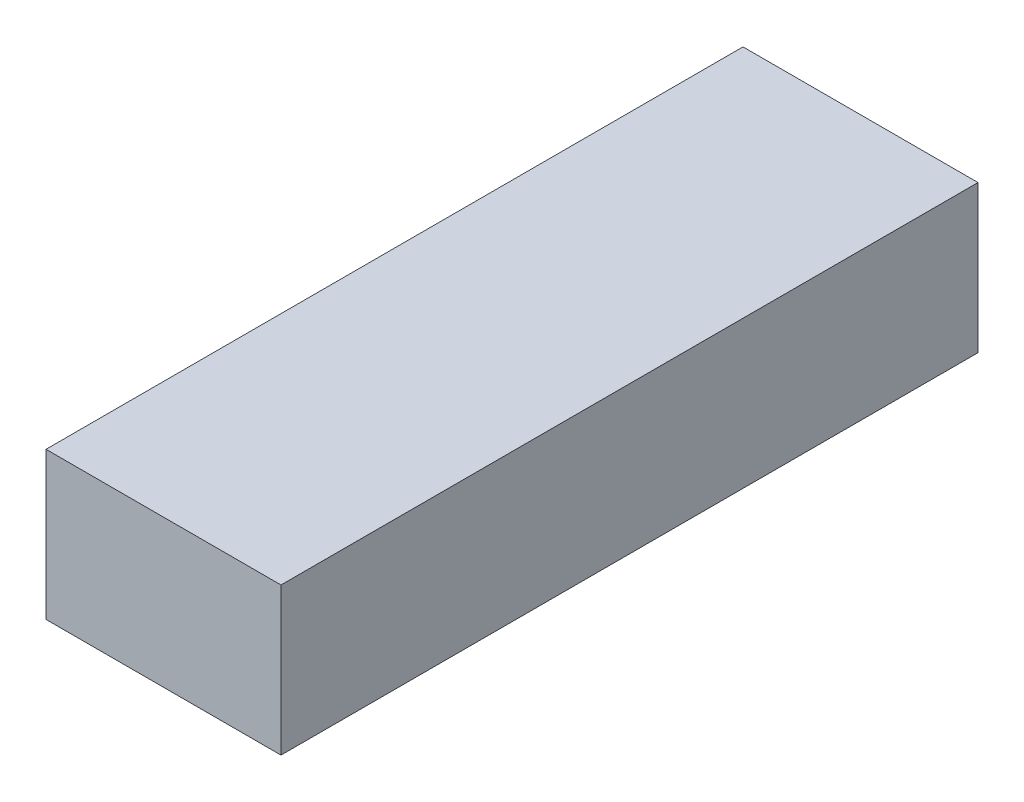
ISO-10303-21;
HEADER;
FILE_DESCRIPTION(('STEP AP214'),'2;1');
FILE_NAME('part.step','',(''),(''),'','','');
FILE_SCHEMA(('AUTOMOTIVE_DESIGN { 1 0 10303 214 1 1 1 1 }'));
ENDSEC;
DATA;
#1=APPLICATION_CONTEXT('core data for automotive mechanical design processes');
#2=APPLICATION_PROTOCOL_DEFINITION('international standard','automotive_design',2000,#1);
#3=PRODUCT_CONTEXT('',#1,'mechanical');
#4=PRODUCT('Part','Part','',(#3));
#5=PRODUCT_RELATED_PRODUCT_CATEGORY('part','',(#4));
#6=PRODUCT_DEFINITION_FORMATION('','',#4);
#7=PRODUCT_DEFINITION_CONTEXT('part definition',#1,'design');
#8=PRODUCT_DEFINITION('design','',#6,#7);
#9=PRODUCT_DEFINITION_SHAPE('','',#8);
#10=(LENGTH_UNIT() NAMED_UNIT(*) SI_UNIT(.MILLI.,.METRE.));
#11=(NAMED_UNIT(*) PLANE_ANGLE_UNIT() SI_UNIT($,.RADIAN.));
#12=(NAMED_UNIT(*) SI_UNIT($,.STERADIAN.) SOLID_ANGLE_UNIT());
#13=UNCERTAINTY_MEASURE_WITH_UNIT(LENGTH_MEASURE(1.E-05),#10,'distance_accuracy_value','');
#14=(GEOMETRIC_REPRESENTATION_CONTEXT(3) GLOBAL_UNCERTAINTY_ASSIGNED_CONTEXT((#13)) GLOBAL_UNIT_ASSIGNED_CONTEXT((#10,
#11,#12)) REPRESENTATION_CONTEXT('',''));
#15=CARTESIAN_POINT('',(0.,0.,0.));
#16=DIRECTION('',(0.,0.,1.));
#17=DIRECTION('',(1.,0.,0.));
#18=AXIS2_PLACEMENT_3D('',#15,#16,#17);
#19=CARTESIAN_POINT('',(0.,2.8,0.));
#20=DIRECTION('',(0.,1.,0.));
#21=DIRECTION('',(0.,0.,1.));
#22=AXIS2_PLACEMENT_3D('',#19,#20,#21);
#23=PLANE('',#22);
#24=CARTESIAN_POINT('',(0.,2.8,-19.9867964562161));
#25=DIRECTION('',(0.,1.,0.));
#26=DIRECTION('',(0.,0.,-1.));
#27=AXIS2_PLACEMENT_3D('',#24,#25,#26);
#28=ELLIPSE('',#27,4.1886347740287,4.125);
#29=CARTESIAN_POINT('',(-3.4,2.8,-17.6150361499228));
#30=VERTEX_POINT('',#29);
#31=CARTESIAN_POINT('',(3.4,2.8,-17.6150361499228));
#32=VERTEX_POINT('',#31);
#33=EDGE_CURVE('E157',#30,#32,#28,.T.);
#34=ORIENTED_EDGE('',*,*,#33,.F.);
#35=DIRECTION('',(0.,0.,1.));
#36=VECTOR('',#35,1.);
#37=CARTESIAN_POINT('',(-3.4,2.8,0.));
#38=LINE('',#37,#36);
#39=CARTESIAN_POINT('',(-3.4,2.8,-3.9));
#40=VERTEX_POINT('',#39);
#41=EDGE_CURVE('E190',#30,#40,#38,.T.);
#42=ORIENTED_EDGE('',*,*,#41,.T.);
#43=DIRECTION('',(-1.,0.,0.));
#44=VECTOR('',#43,1.);
#45=CARTESIAN_POINT('',(-3.9,2.8,-3.9));
#46=LINE('',#45,#44);
#47=CARTESIAN_POINT('',(3.4,2.8,-3.9));
#48=VERTEX_POINT('',#47);
#49=EDGE_CURVE('E220',#48,#40,#46,.T.);
#50=ORIENTED_EDGE('',*,*,#49,.F.);
#51=DIRECTION('',(0.,0.,1.));
#52=VECTOR('',#51,1.);
#53=CARTESIAN_POINT('',(3.4,2.8,0.));
#54=LINE('',#53,#52);
#55=EDGE_CURVE('E199',#32,#48,#54,.T.);
#56=ORIENTED_EDGE('',*,*,#55,.F.);
#57=EDGE_LOOP('',(#34,#42,#50,#56));
#58=FACE_BOUND('',#57,.T.);
#59=ADVANCED_FACE('F34',(#58),#23,.T.);
#60=CARTESIAN_POINT('',(-3.4,5.8,0.));
#61=DIRECTION('',(1.,0.,0.));
#62=DIRECTION('',(0.,0.,-1.));
#63=AXIS2_PLACEMENT_3D('',#60,#61,#62);
#64=PLANE('',#63);
#65=DIRECTION('',(0.,-0.984807753012208,-0.173648177666931));
#66=VECTOR('',#65,1.);
#67=CARTESIAN_POINT('',(-3.4,16.9730410274829,-15.1159466180895));
#68=LINE('',#67,#66);
#69=CARTESIAN_POINT('',(-3.4,5.8,-17.0860552077974));
#70=VERTEX_POINT('',#69);
#71=EDGE_CURVE('E299',#70,#30,#68,.T.);
#72=ORIENTED_EDGE('',*,*,#71,.F.);
#73=DIRECTION('',(0.,0.,1.));
#74=VECTOR('',#73,1.);
#75=CARTESIAN_POINT('',(-3.4,5.8,0.));
#76=LINE('',#75,#74);
#77=CARTESIAN_POINT('',(-3.4,5.8,3.4));
#78=VERTEX_POINT('',#77);
#79=EDGE_CURVE('E202',#70,#78,#76,.T.);
#80=ORIENTED_EDGE('',*,*,#79,.T.);
#81=DIRECTION('',(0.,-1.,0.));
#82=VECTOR('',#81,1.);
#83=CARTESIAN_POINT('',(-3.4,5.8,3.4));
#84=LINE('',#83,#82);
#85=CARTESIAN_POINT('',(-3.4,2.8,3.4));
#86=VERTEX_POINT('',#85);
#87=EDGE_CURVE('E187',#78,#86,#84,.T.);
#88=ORIENTED_EDGE('',*,*,#87,.T.);
#89=EDGE_CURVE('E191',#40,#86,#38,.T.);
#90=ORIENTED_EDGE('',*,*,#89,.F.);
#91=ORIENTED_EDGE('',*,*,#41,.F.);
#92=EDGE_LOOP('',(#72,#80,#88,#90,#91));
#93=FACE_BOUND('',#92,.T.);
#94=ADVANCED_FACE('F294',(#93),#64,.T.);
#95=CARTESIAN_POINT('',(3.4,5.8,0.));
#96=DIRECTION('',(1.,0.,0.));
#97=DIRECTION('',(0.,0.,-1.));
#98=AXIS2_PLACEMENT_3D('',#95,#96,#97);
#99=PLANE('',#98);
#100=DIRECTION('',(0.,0.,1.));
#101=VECTOR('',#100,1.);
#102=CARTESIAN_POINT('',(3.4,5.8,0.));
#103=LINE('',#102,#101);
#104=CARTESIAN_POINT('',(3.4,5.8,-17.0860552077974));
#105=VERTEX_POINT('',#104);
#106=CARTESIAN_POINT('',(3.4,5.8,3.4));
#107=VERTEX_POINT('',#106);
#108=EDGE_CURVE('E167',#105,#107,#103,.T.);
#109=ORIENTED_EDGE('',*,*,#108,.F.);
#110=DIRECTION('',(0.,-0.984807753012208,-0.173648177666931));
#111=VECTOR('',#110,1.);
#112=CARTESIAN_POINT('',(3.4,16.9730410274829,-15.1159466180895));
#113=LINE('',#112,#111);
#114=EDGE_CURVE('E153',#105,#32,#113,.T.);
#115=ORIENTED_EDGE('',*,*,#114,.T.);
#116=ORIENTED_EDGE('',*,*,#55,.T.);
#117=CARTESIAN_POINT('',(3.4,2.8,3.4));
#118=VERTEX_POINT('',#117);
#119=EDGE_CURVE('E194',#48,#118,#54,.T.);
#120=ORIENTED_EDGE('',*,*,#119,.T.);
#121=DIRECTION('',(0.,-1.,0.));
#122=VECTOR('',#121,1.);
#123=CARTESIAN_POINT('',(3.4,5.8,3.4));
#124=LINE('',#123,#122);
#125=EDGE_CURVE('E176',#107,#118,#124,.T.);
#126=ORIENTED_EDGE('',*,*,#125,.F.);
#127=EDGE_LOOP('',(#109,#115,#116,#120,#126));
#128=FACE_BOUND('',#127,.T.);
#129=ADVANCED_FACE('F174',(#128),#99,.F.);
#130=CARTESIAN_POINT('',(3.4,2.8,-22.3585567625094));
#131=VERTEX_POINT('',#130);
#132=CARTESIAN_POINT('',(-3.4,2.8,-22.3585567625094));
#133=VERTEX_POINT('',#132);
#134=EDGE_CURVE('E312',#131,#133,#28,.T.);
#135=ORIENTED_EDGE('',*,*,#134,.F.);
#136=CARTESIAN_POINT('',(3.4,2.8,-24.7));
#137=VERTEX_POINT('',#136);
#138=EDGE_CURVE('E195',#137,#131,#54,.T.);
#139=ORIENTED_EDGE('',*,*,#138,.F.);
#140=DIRECTION('',(-1.,0.,0.));
#141=VECTOR('',#140,1.);
#142=CARTESIAN_POINT('',(0.,2.8,-24.7));
#143=LINE('',#142,#141);
#144=CARTESIAN_POINT('',(-3.4,2.8,-24.7));
#145=VERTEX_POINT('',#144);
#146=EDGE_CURVE('E189',#137,#145,#143,.T.);
#147=ORIENTED_EDGE('',*,*,#146,.T.);
#148=EDGE_CURVE('E57',#145,#133,#38,.T.);
#149=ORIENTED_EDGE('',*,*,#148,.T.);
#150=EDGE_LOOP('',(#135,#139,#147,#149));
#151=FACE_BOUND('',#150,.T.);
#152=ADVANCED_FACE('F322',(#151),#23,.T.);
#153=CARTESIAN_POINT('',(0.,0.,0.));
#154=DIRECTION('',(0.,1.,0.));
#155=DIRECTION('',(0.,0.,1.));
#156=AXIS2_PLACEMENT_3D('',#153,#154,#155);
#157=PLANE('',#156);
#158=CARTESIAN_POINT('',(0.,0.,-20.4805120021998));
#159=DIRECTION('',(0.,1.,0.));
#160=DIRECTION('',(0.,0.,-1.));
#161=AXIS2_PLACEMENT_3D('',#158,#159,#160);
#162=ELLIPSE('',#161,4.1886347740287,4.125);
#163=CARTESIAN_POINT('',(0.,0.,-24.6691467762285));
#164=VERTEX_POINT('',#163);
#165=EDGE_CURVE('E313',#164,#164,#162,.T.);
#166=ORIENTED_EDGE('',*,*,#165,.T.);
#167=EDGE_LOOP('',(#166));
#168=FACE_BOUND('',#167,.T.);
#169=DIRECTION('',(0.,0.,-1.));
#170=VECTOR('',#169,1.);
#171=CARTESIAN_POINT('',(5.9,0.,-26.7));
#172=LINE('',#171,#170);
#173=CARTESIAN_POINT('',(5.9,0.,8.3));
#174=VERTEX_POINT('',#173);
#175=CARTESIAN_POINT('',(5.9,0.,-26.7));
#176=VERTEX_POINT('',#175);
#177=EDGE_CURVE('E246',#174,#176,#172,.T.);
#178=ORIENTED_EDGE('',*,*,#177,.F.);
#179=DIRECTION('',(1.,0.,0.));
#180=VECTOR('',#179,1.);
#181=CARTESIAN_POINT('',(-5.9,0.,8.3));
#182=LINE('',#181,#180);
#183=CARTESIAN_POINT('',(-5.9,0.,8.3));
#184=VERTEX_POINT('',#183);
#185=EDGE_CURVE('E253',#184,#174,#182,.T.);
#186=ORIENTED_EDGE('',*,*,#185,.F.);
#187=DIRECTION('',(0.,0.,1.));
#188=VECTOR('',#187,1.);
#189=CARTESIAN_POINT('',(-5.9,0.,-26.7));
#190=LINE('',#189,#188);
#191=CARTESIAN_POINT('',(-5.9,0.,-26.7));
#192=VERTEX_POINT('',#191);
#193=EDGE_CURVE('E251',#192,#184,#190,.T.);
#194=ORIENTED_EDGE('',*,*,#193,.F.);
#195=DIRECTION('',(-1.,0.,0.));
#196=VECTOR('',#195,1.);
#197=CARTESIAN_POINT('',(-5.9,0.,-26.7));
#198=LINE('',#197,#196);
#199=EDGE_CURVE('E249',#176,#192,#198,.T.);
#200=ORIENTED_EDGE('',*,*,#199,.F.);
#201=EDGE_LOOP('',(#178,#186,#194,#200));
#202=FACE_BOUND('',#201,.T.);
#203=DIRECTION('',(0.,0.,-1.));
#204=VECTOR('',#203,1.);
#205=CARTESIAN_POINT('',(3.9,0.,-3.9));
#206=LINE('',#205,#204);
#207=CARTESIAN_POINT('',(3.9,0.,3.9));
#208=VERTEX_POINT('',#207);
#209=CARTESIAN_POINT('',(3.9,0.,-3.9));
#210=VERTEX_POINT('',#209);
#211=EDGE_CURVE('E210',#208,#210,#206,.T.);
#212=ORIENTED_EDGE('',*,*,#211,.T.);
#213=DIRECTION('',(-1.,0.,0.));
#214=VECTOR('',#213,1.);
#215=CARTESIAN_POINT('',(-3.9,0.,-3.9));
#216=LINE('',#215,#214);
#217=CARTESIAN_POINT('',(-3.9,0.,-3.9));
#218=VERTEX_POINT('',#217);
#219=EDGE_CURVE('E229',#210,#218,#216,.T.);
#220=ORIENTED_EDGE('',*,*,#219,.T.);
#221=DIRECTION('',(0.,0.,1.));
#222=VECTOR('',#221,1.);
#223=CARTESIAN_POINT('',(-3.9,0.,-3.9));
#224=LINE('',#223,#222);
#225=CARTESIAN_POINT('',(-3.9,0.,3.9));
#226=VERTEX_POINT('',#225);
#227=EDGE_CURVE('E232',#218,#226,#224,.T.);
#228=ORIENTED_EDGE('',*,*,#227,.T.);
#229=DIRECTION('',(1.,0.,0.));
#230=VECTOR('',#229,1.);
#231=CARTESIAN_POINT('',(-3.9,0.,3.9));
#232=LINE('',#231,#230);
#233=EDGE_CURVE('E215',#226,#208,#232,.T.);
#234=ORIENTED_EDGE('',*,*,#233,.T.);
#235=EDGE_LOOP('',(#212,#220,#228,#234));
#236=FACE_BOUND('',#235,.T.);
#237=ADVANCED_FACE('F273',(#168,#202,#236),#157,.F.);
#238=CARTESIAN_POINT('',(5.9,2.8,-26.7));
#239=DIRECTION('',(-1.,0.,0.));
#240=DIRECTION('',(0.,0.,1.));
#241=AXIS2_PLACEMENT_3D('',#238,#239,#240);
#242=PLANE('',#241);
#243=ORIENTED_EDGE('',*,*,#177,.T.);
#244=DIRECTION('',(0.,-1.,0.));
#245=VECTOR('',#244,1.);
#246=CARTESIAN_POINT('',(5.9,2.8,-26.7));
#247=LINE('',#246,#245);
#248=CARTESIAN_POINT('',(5.9,7.4,-26.7));
#249=VERTEX_POINT('',#248);
#250=EDGE_CURVE('E11',#249,#176,#247,.T.);
#251=ORIENTED_EDGE('',*,*,#250,.F.);
#252=DIRECTION('',(0.,0.,-1.));
#253=VECTOR('',#252,1.);
#254=CARTESIAN_POINT('',(5.9,7.4,8.3));
#255=LINE('',#254,#253);
#256=CARTESIAN_POINT('',(5.9,7.4,8.3));
#257=VERTEX_POINT('',#256);
#258=EDGE_CURVE('E282',#257,#249,#255,.T.);
#259=ORIENTED_EDGE('',*,*,#258,.F.);
#260=DIRECTION('',(0.,-1.,0.));
#261=VECTOR('',#260,1.);
#262=CARTESIAN_POINT('',(5.9,2.8,8.3));
#263=LINE('',#262,#261);
#264=EDGE_CURVE('E255',#257,#174,#263,.T.);
#265=ORIENTED_EDGE('',*,*,#264,.T.);
#266=EDGE_LOOP('',(#243,#251,#259,#265));
#267=FACE_BOUND('',#266,.T.);
#268=ADVANCED_FACE('F36',(#267),#242,.F.);
#269=CARTESIAN_POINT('',(-5.9,2.8,-26.7));
#270=DIRECTION('',(0.,0.,1.));
#271=DIRECTION('',(1.,0.,0.));
#272=AXIS2_PLACEMENT_3D('',#269,#270,#271);
#273=PLANE('',#272);
#274=ORIENTED_EDGE('',*,*,#199,.T.);
#275=DIRECTION('',(0.,-1.,0.));
#276=VECTOR('',#275,1.);
#277=CARTESIAN_POINT('',(-5.9,2.8,-26.7));
#278=LINE('',#277,#276);
#279=CARTESIAN_POINT('',(-5.9,7.4,-26.7));
#280=VERTEX_POINT('',#279);
#281=EDGE_CURVE('E42',#280,#192,#278,.T.);
#282=ORIENTED_EDGE('',*,*,#281,.F.);
#283=DIRECTION('',(-1.,0.,0.));
#284=VECTOR('',#283,1.);
#285=CARTESIAN_POINT('',(5.9,7.4,-26.7));
#286=LINE('',#285,#284);
#287=EDGE_CURVE('E284',#249,#280,#286,.T.);
#288=ORIENTED_EDGE('',*,*,#287,.F.);
#289=ORIENTED_EDGE('',*,*,#250,.T.);
#290=EDGE_LOOP('',(#274,#282,#288,#289));
#291=FACE_BOUND('',#290,.T.);
#292=ADVANCED_FACE('F399',(#291),#273,.F.);
#293=CARTESIAN_POINT('',(-5.9,2.8,-26.7));
#294=DIRECTION('',(1.,0.,0.));
#295=DIRECTION('',(0.,0.,-1.));
#296=AXIS2_PLACEMENT_3D('',#293,#294,#295);
#297=PLANE('',#296);
#298=ORIENTED_EDGE('',*,*,#193,.T.);
#299=DIRECTION('',(0.,-1.,0.));
#300=VECTOR('',#299,1.);
#301=CARTESIAN_POINT('',(-5.9,2.8,8.3));
#302=LINE('',#301,#300);
#303=CARTESIAN_POINT('',(-5.9,7.4,8.3));
#304=VERTEX_POINT('',#303);
#305=EDGE_CURVE('E258',#304,#184,#302,.T.);
#306=ORIENTED_EDGE('',*,*,#305,.F.);
#307=DIRECTION('',(0.,0.,1.));
#308=VECTOR('',#307,1.);
#309=CARTESIAN_POINT('',(-5.9,7.4,-26.7));
#310=LINE('',#309,#308);
#311=EDGE_CURVE('E266',#280,#304,#310,.T.);
#312=ORIENTED_EDGE('',*,*,#311,.F.);
#313=ORIENTED_EDGE('',*,*,#281,.T.);
#314=EDGE_LOOP('',(#298,#306,#312,#313));
#315=FACE_BOUND('',#314,.T.);
#316=ADVANCED_FACE('F264',(#315),#297,.F.);
#317=CARTESIAN_POINT('',(-5.9,2.8,8.3));
#318=DIRECTION('',(0.,0.,-1.));
#319=DIRECTION('',(-1.,0.,0.));
#320=AXIS2_PLACEMENT_3D('',#317,#318,#319);
#321=PLANE('',#320);
#322=ORIENTED_EDGE('',*,*,#185,.T.);
#323=ORIENTED_EDGE('',*,*,#264,.F.);
#324=DIRECTION('',(1.,0.,0.));
#325=VECTOR('',#324,1.);
#326=CARTESIAN_POINT('',(-5.9,7.4,8.3));
#327=LINE('',#326,#325);
#328=EDGE_CURVE('E285',#304,#257,#327,.T.);
#329=ORIENTED_EDGE('',*,*,#328,.F.);
#330=ORIENTED_EDGE('',*,*,#305,.T.);
#331=EDGE_LOOP('',(#322,#323,#329,#330));
#332=FACE_BOUND('',#331,.T.);
#333=ADVANCED_FACE('F276',(#332),#321,.F.);
#334=CARTESIAN_POINT('',(3.9,2.8,-3.9));
#335=DIRECTION('',(-1.,0.,0.));
#336=DIRECTION('',(0.,0.,1.));
#337=AXIS2_PLACEMENT_3D('',#334,#335,#336);
#338=PLANE('',#337);
#339=ORIENTED_EDGE('',*,*,#211,.F.);
#340=DIRECTION('',(0.,-1.,0.));
#341=VECTOR('',#340,1.);
#342=CARTESIAN_POINT('',(3.9,2.8,3.9));
#343=LINE('',#342,#341);
#344=CARTESIAN_POINT('',(3.9,2.8,3.9));
#345=VERTEX_POINT('',#344);
#346=EDGE_CURVE('E226',#345,#208,#343,.T.);
#347=ORIENTED_EDGE('',*,*,#346,.F.);
#348=DIRECTION('',(0.,0.,-1.));
#349=VECTOR('',#348,1.);
#350=CARTESIAN_POINT('',(3.9,2.8,-3.9));
#351=LINE('',#350,#349);
#352=CARTESIAN_POINT('',(3.9,2.8,-3.9));
#353=VERTEX_POINT('',#352);
#354=EDGE_CURVE('E211',#345,#353,#351,.T.);
#355=ORIENTED_EDGE('',*,*,#354,.T.);
#356=DIRECTION('',(0.,-1.,0.));
#357=VECTOR('',#356,1.);
#358=CARTESIAN_POINT('',(3.9,2.8,-3.9));
#359=LINE('',#358,#357);
#360=EDGE_CURVE('E243',#353,#210,#359,.T.);
#361=ORIENTED_EDGE('',*,*,#360,.T.);
#362=EDGE_LOOP('',(#339,#347,#355,#361));
#363=FACE_BOUND('',#362,.T.);
#364=ADVANCED_FACE('F425',(#363),#338,.T.);
#365=CARTESIAN_POINT('',(-3.9,2.8,-3.9));
#366=DIRECTION('',(0.,0.,1.));
#367=DIRECTION('',(1.,0.,0.));
#368=AXIS2_PLACEMENT_3D('',#365,#366,#367);
#369=PLANE('',#368);
#370=ORIENTED_EDGE('',*,*,#219,.F.);
#371=ORIENTED_EDGE('',*,*,#360,.F.);
#372=EDGE_CURVE('E216',#353,#48,#46,.T.);
#373=ORIENTED_EDGE('',*,*,#372,.T.);
#374=ORIENTED_EDGE('',*,*,#49,.T.);
#375=CARTESIAN_POINT('',(-3.9,2.8,-3.9));
#376=VERTEX_POINT('',#375);
#377=EDGE_CURVE('E214',#40,#376,#46,.T.);
#378=ORIENTED_EDGE('',*,*,#377,.T.);
#379=DIRECTION('',(0.,-1.,0.));
#380=VECTOR('',#379,1.);
#381=CARTESIAN_POINT('',(-3.9,2.8,-3.9));
#382=LINE('',#381,#380);
#383=EDGE_CURVE('E241',#376,#218,#382,.T.);
#384=ORIENTED_EDGE('',*,*,#383,.T.);
#385=EDGE_LOOP('',(#370,#371,#373,#374,#378,#384));
#386=FACE_BOUND('',#385,.T.);
#387=ADVANCED_FACE('F536',(#386),#369,.T.);
#388=CARTESIAN_POINT('',(-3.9,2.8,-3.9));
#389=DIRECTION('',(1.,0.,0.));
#390=DIRECTION('',(0.,0.,-1.));
#391=AXIS2_PLACEMENT_3D('',#388,#389,#390);
#392=PLANE('',#391);
#393=ORIENTED_EDGE('',*,*,#227,.F.);
#394=ORIENTED_EDGE('',*,*,#383,.F.);
#395=DIRECTION('',(0.,0.,1.));
#396=VECTOR('',#395,1.);
#397=CARTESIAN_POINT('',(-3.9,2.8,-3.9));
#398=LINE('',#397,#396);
#399=CARTESIAN_POINT('',(-3.9,2.8,3.9));
#400=VERTEX_POINT('',#399);
#401=EDGE_CURVE('E219',#376,#400,#398,.T.);
#402=ORIENTED_EDGE('',*,*,#401,.T.);
#403=DIRECTION('',(0.,-1.,0.));
#404=VECTOR('',#403,1.);
#405=CARTESIAN_POINT('',(-3.9,2.8,3.9));
#406=LINE('',#405,#404);
#407=EDGE_CURVE('E239',#400,#226,#406,.T.);
#408=ORIENTED_EDGE('',*,*,#407,.T.);
#409=EDGE_LOOP('',(#393,#394,#402,#408));
#410=FACE_BOUND('',#409,.T.);
#411=ADVANCED_FACE('F336',(#410),#392,.T.);
#412=CARTESIAN_POINT('',(-3.9,2.8,3.9));
#413=DIRECTION('',(0.,0.,-1.));
#414=DIRECTION('',(-1.,0.,0.));
#415=AXIS2_PLACEMENT_3D('',#412,#413,#414);
#416=PLANE('',#415);
#417=ORIENTED_EDGE('',*,*,#233,.F.);
#418=ORIENTED_EDGE('',*,*,#407,.F.);
#419=DIRECTION('',(1.,0.,0.));
#420=VECTOR('',#419,1.);
#421=CARTESIAN_POINT('',(-3.9,2.8,3.9));
#422=LINE('',#421,#420);
#423=EDGE_CURVE('E223',#400,#345,#422,.T.);
#424=ORIENTED_EDGE('',*,*,#423,.T.);
#425=ORIENTED_EDGE('',*,*,#346,.T.);
#426=EDGE_LOOP('',(#417,#418,#424,#425));
#427=FACE_BOUND('',#426,.T.);
#428=ADVANCED_FACE('F329',(#427),#416,.T.);
#429=DIRECTION('',(0.,-0.984807753012208,-0.173648177666931));
#430=VECTOR('',#429,1.);
#431=CARTESIAN_POINT('',(-3.4,17.7842308273755,-19.7164325824796));
#432=LINE('',#431,#430);
#433=CARTESIAN_POINT('',(-3.4,5.8,-21.829575820384));
#434=VERTEX_POINT('',#433);
#435=EDGE_CURVE('E161',#133,#434,#432,.F.);
#436=ORIENTED_EDGE('',*,*,#435,.F.);
#437=ORIENTED_EDGE('',*,*,#148,.F.);
#438=DIRECTION('',(0.,-1.,0.));
#439=VECTOR('',#438,1.);
#440=CARTESIAN_POINT('',(-3.4,5.8,-24.7));
#441=LINE('',#440,#439);
#442=CARTESIAN_POINT('',(-3.4,5.8,-24.7));
#443=VERTEX_POINT('',#442);
#444=EDGE_CURVE('E208',#443,#145,#441,.T.);
#445=ORIENTED_EDGE('',*,*,#444,.F.);
#446=EDGE_CURVE('E182',#443,#434,#76,.T.);
#447=ORIENTED_EDGE('',*,*,#446,.T.);
#448=EDGE_LOOP('',(#436,#437,#445,#447));
#449=FACE_BOUND('',#448,.T.);
#450=ADVANCED_FACE('F327',(#449),#64,.T.);
#451=CARTESIAN_POINT('',(0.,5.8,-24.7));
#452=DIRECTION('',(0.,0.,1.));
#453=DIRECTION('',(1.,0.,0.));
#454=AXIS2_PLACEMENT_3D('',#451,#452,#453);
#455=PLANE('',#454);
#456=ORIENTED_EDGE('',*,*,#146,.F.);
#457=DIRECTION('',(0.,-1.,0.));
#458=VECTOR('',#457,1.);
#459=CARTESIAN_POINT('',(3.4,5.8,-24.7));
#460=LINE('',#459,#458);
#461=CARTESIAN_POINT('',(3.4,5.8,-24.7));
#462=VERTEX_POINT('',#461);
#463=EDGE_CURVE('E206',#462,#137,#460,.T.);
#464=ORIENTED_EDGE('',*,*,#463,.F.);
#465=DIRECTION('',(-1.,0.,0.));
#466=VECTOR('',#465,1.);
#467=CARTESIAN_POINT('',(0.,5.8,-24.7));
#468=LINE('',#467,#466);
#469=EDGE_CURVE('E178',#462,#443,#468,.T.);
#470=ORIENTED_EDGE('',*,*,#469,.T.);
#471=ORIENTED_EDGE('',*,*,#444,.T.);
#472=EDGE_LOOP('',(#456,#464,#470,#471));
#473=FACE_BOUND('',#472,.T.);
#474=ADVANCED_FACE('F326',(#473),#455,.T.);
#475=ORIENTED_EDGE('',*,*,#138,.T.);
#476=DIRECTION('',(0.,-0.984807753012208,-0.173648177666931));
#477=VECTOR('',#476,1.);
#478=CARTESIAN_POINT('',(3.4,17.7842308273755,-19.7164325824796));
#479=LINE('',#478,#477);
#480=CARTESIAN_POINT('',(3.4,5.8,-21.829575820384));
#481=VERTEX_POINT('',#480);
#482=EDGE_CURVE('E171',#131,#481,#479,.F.);
#483=ORIENTED_EDGE('',*,*,#482,.T.);
#484=EDGE_CURVE('E170',#462,#481,#103,.T.);
#485=ORIENTED_EDGE('',*,*,#484,.F.);
#486=ORIENTED_EDGE('',*,*,#463,.T.);
#487=EDGE_LOOP('',(#475,#483,#485,#486));
#488=FACE_BOUND('',#487,.T.);
#489=ADVANCED_FACE('F319',(#488),#99,.F.);
#490=CARTESIAN_POINT('',(0.,5.8,3.4));
#491=DIRECTION('',(0.,0.,-1.));
#492=DIRECTION('',(-1.,0.,0.));
#493=AXIS2_PLACEMENT_3D('',#490,#491,#492);
#494=PLANE('',#493);
#495=DIRECTION('',(1.,0.,0.));
#496=VECTOR('',#495,1.);
#497=CARTESIAN_POINT('',(0.,2.8,3.4));
#498=LINE('',#497,#496);
#499=EDGE_CURVE('E198',#86,#118,#498,.T.);
#500=ORIENTED_EDGE('',*,*,#499,.F.);
#501=ORIENTED_EDGE('',*,*,#87,.F.);
#502=DIRECTION('',(1.,0.,0.));
#503=VECTOR('',#502,1.);
#504=CARTESIAN_POINT('',(0.,5.8,3.4));
#505=LINE('',#504,#503);
#506=EDGE_CURVE('E180',#78,#107,#505,.T.);
#507=ORIENTED_EDGE('',*,*,#506,.T.);
#508=ORIENTED_EDGE('',*,*,#125,.T.);
#509=EDGE_LOOP('',(#500,#501,#507,#508));
#510=FACE_BOUND('',#509,.T.);
#511=ADVANCED_FACE('F302',(#510),#494,.T.);
#512=CARTESIAN_POINT('',(0.,2.8,0.));
#513=DIRECTION('',(0.,1.,0.));
#514=DIRECTION('',(0.,0.,1.));
#515=AXIS2_PLACEMENT_3D('',#512,#513,#514);
#516=PLANE('',#515);
#517=ORIENTED_EDGE('',*,*,#372,.F.);
#518=ORIENTED_EDGE('',*,*,#354,.F.);
#519=ORIENTED_EDGE('',*,*,#423,.F.);
#520=ORIENTED_EDGE('',*,*,#401,.F.);
#521=ORIENTED_EDGE('',*,*,#377,.F.);
#522=ORIENTED_EDGE('',*,*,#89,.T.);
#523=ORIENTED_EDGE('',*,*,#499,.T.);
#524=ORIENTED_EDGE('',*,*,#119,.F.);
#525=EDGE_LOOP('',(#517,#518,#519,#520,#521,#522,#523,#524));
#526=FACE_BOUND('',#525,.T.);
#527=ADVANCED_FACE('F305',(#526),#516,.F.);
#528=CARTESIAN_POINT('',(0.,7.4,0.));
#529=DIRECTION('',(0.,1.,0.));
#530=DIRECTION('',(0.,0.,1.));
#531=AXIS2_PLACEMENT_3D('',#528,#529,#530);
#532=PLANE('',#531);
#533=ORIENTED_EDGE('',*,*,#311,.T.);
#534=ORIENTED_EDGE('',*,*,#328,.T.);
#535=ORIENTED_EDGE('',*,*,#258,.T.);
#536=ORIENTED_EDGE('',*,*,#287,.T.);
#537=EDGE_LOOP('',(#533,#534,#535,#536));
#538=FACE_BOUND('',#537,.T.);
#539=ADVANCED_FACE('F363',(#538),#532,.T.);
#540=CARTESIAN_POINT('',(0.,5.8,0.));
#541=DIRECTION('',(0.,1.,0.));
#542=DIRECTION('',(0.,0.,1.));
#543=AXIS2_PLACEMENT_3D('',#540,#541,#542);
#544=PLANE('',#543);
#545=ORIENTED_EDGE('',*,*,#484,.T.);
#546=CARTESIAN_POINT('',(0.,5.8,-19.4578155140907));
#547=DIRECTION('',(0.,1.,0.));
#548=DIRECTION('',(0.,0.,-1.));
#549=AXIS2_PLACEMENT_3D('',#546,#547,#548);
#550=ELLIPSE('',#549,4.1886347740287,4.125);
#551=EDGE_CURVE('E49',#481,#105,#550,.F.);
#552=ORIENTED_EDGE('',*,*,#551,.T.);
#553=ORIENTED_EDGE('',*,*,#108,.T.);
#554=ORIENTED_EDGE('',*,*,#506,.F.);
#555=ORIENTED_EDGE('',*,*,#79,.F.);
#556=EDGE_CURVE('E172',#70,#434,#550,.F.);
#557=ORIENTED_EDGE('',*,*,#556,.T.);
#558=ORIENTED_EDGE('',*,*,#446,.F.);
#559=ORIENTED_EDGE('',*,*,#469,.F.);
#560=EDGE_LOOP('',(#545,#552,#553,#554,#555,#557,#558,#559));
#561=FACE_BOUND('',#560,.T.);
#562=ADVANCED_FACE('F165',(#561),#544,.F.);
#563=CARTESIAN_POINT('',(0.,17.3786359274292,-17.4161896002846));
#564=DIRECTION('',(0.,-0.984807753012208,-0.173648177666931));
#565=DIRECTION('',(0.,0.173648177666931,-0.984807753012208));
#566=AXIS2_PLACEMENT_3D('',#563,#564,#565);
#567=CYLINDRICAL_SURFACE('',#566,4.125);
#568=ORIENTED_EDGE('',*,*,#71,.T.);
#569=ORIENTED_EDGE('',*,*,#33,.T.);
#570=ORIENTED_EDGE('',*,*,#114,.F.);
#571=ORIENTED_EDGE('',*,*,#551,.F.);
#572=ORIENTED_EDGE('',*,*,#482,.F.);
#573=ORIENTED_EDGE('',*,*,#134,.T.);
#574=ORIENTED_EDGE('',*,*,#435,.T.);
#575=ORIENTED_EDGE('',*,*,#556,.F.);
#576=EDGE_LOOP('',(#568,#569,#570,#571,#572,#573,#574,#575));
#577=FACE_BOUND('',#576,.T.);
#578=ORIENTED_EDGE('',*,*,#165,.F.);
#579=EDGE_LOOP('',(#578));
#580=FACE_BOUND('',#579,.T.);
#581=ADVANCED_FACE('F154',(#577,#580),#567,.F.);
#582=CLOSED_SHELL('',(#59,#94,#129,#152,#237,#268,#292,#316,#333,#364,#387,#411,#428,#450,#474,
#489,#511,#527,#539,#562,#581));
#583=MANIFOLD_SOLID_BREP('B2',#582);
#584=ADVANCED_BREP_SHAPE_REPRESENTATION('',(#18,#583),#14);
#585=SHAPE_DEFINITION_REPRESENTATION(#9,#584);
ENDSEC;
END-ISO-10303-21;
